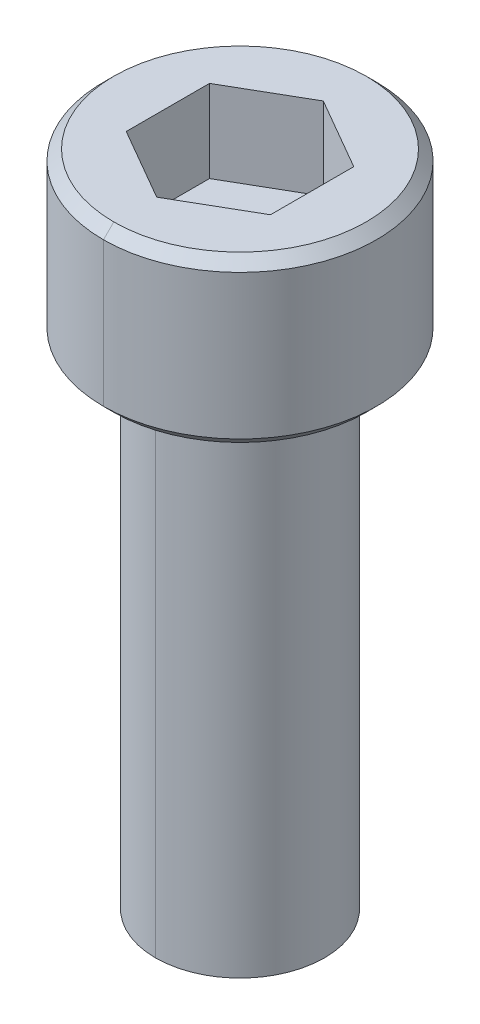
ISO-10303-21;
HEADER;
FILE_DESCRIPTION(('STEP AP214'),'2;1');
FILE_NAME('part.step','',(''),(''),'','','');
FILE_SCHEMA(('AUTOMOTIVE_DESIGN { 1 0 10303 214 1 1 1 1 }'));
ENDSEC;
DATA;
#1=APPLICATION_CONTEXT('core data for automotive mechanical design processes');
#2=APPLICATION_PROTOCOL_DEFINITION('international standard','automotive_design',2000,#1);
#3=PRODUCT_CONTEXT('',#1,'mechanical');
#4=PRODUCT('Part','Part','',(#3));
#5=PRODUCT_RELATED_PRODUCT_CATEGORY('part','',(#4));
#6=PRODUCT_DEFINITION_FORMATION('','',#4);
#7=PRODUCT_DEFINITION_CONTEXT('part definition',#1,'design');
#8=PRODUCT_DEFINITION('design','',#6,#7);
#9=PRODUCT_DEFINITION_SHAPE('','',#8);
#10=(LENGTH_UNIT() NAMED_UNIT(*) SI_UNIT(.MILLI.,.METRE.));
#11=(NAMED_UNIT(*) PLANE_ANGLE_UNIT() SI_UNIT($,.RADIAN.));
#12=(NAMED_UNIT(*) SI_UNIT($,.STERADIAN.) SOLID_ANGLE_UNIT());
#13=UNCERTAINTY_MEASURE_WITH_UNIT(LENGTH_MEASURE(1.E-05),#10,'distance_accuracy_value','');
#14=(GEOMETRIC_REPRESENTATION_CONTEXT(3) GLOBAL_UNCERTAINTY_ASSIGNED_CONTEXT((#13)) GLOBAL_UNIT_ASSIGNED_CONTEXT((#10,
#11,#12)) REPRESENTATION_CONTEXT('',''));
#15=CARTESIAN_POINT('',(0.,0.,0.));
#16=DIRECTION('',(0.,0.,1.));
#17=DIRECTION('',(1.,0.,0.));
#18=AXIS2_PLACEMENT_3D('',#15,#16,#17);
#19=CARTESIAN_POINT('',(0.,-12.16152,0.));
#20=DIRECTION('',(0.,1.,0.));
#21=DIRECTION('',(0.,0.,1.));
#22=AXIS2_PLACEMENT_3D('',#19,#20,#21);
#23=CONICAL_SURFACE('',#22,2.0828,0.960291895410485);
#24=DIRECTION('',(0.,0.573280843383967,-0.819358941251615));
#25=VECTOR('',#24,1.);
#26=CARTESIAN_POINT('',(0.,-12.16152,-2.0828));
#27=LINE('',#26,#25);
#28=CARTESIAN_POINT('',(0.,-12.7,-1.31318));
#29=VERTEX_POINT('',#28);
#30=CARTESIAN_POINT('',(0.,-12.16152,-2.0828));
#31=VERTEX_POINT('',#30);
#32=EDGE_CURVE('E160',#29,#31,#27,.T.);
#33=ORIENTED_EDGE('',*,*,#32,.F.);
#34=CARTESIAN_POINT('',(0.,-12.7,0.));
#35=DIRECTION('',(0.,-1.,0.));
#36=DIRECTION('',(0.,0.,1.));
#37=AXIS2_PLACEMENT_3D('',#34,#35,#36);
#38=CIRCLE('',#37,1.31318);
#39=CARTESIAN_POINT('',(0.,-12.7,1.31318));
#40=VERTEX_POINT('',#39);
#41=EDGE_CURVE('E147',#40,#29,#38,.T.);
#42=ORIENTED_EDGE('',*,*,#41,.F.);
#43=DIRECTION('',(0.,0.573280843383967,0.819358941251615));
#44=VECTOR('',#43,1.);
#45=CARTESIAN_POINT('',(0.,-12.16152,2.0828));
#46=LINE('',#45,#44);
#47=CARTESIAN_POINT('',(0.,-12.16152,2.0828));
#48=VERTEX_POINT('',#47);
#49=EDGE_CURVE('E169',#40,#48,#46,.T.);
#50=ORIENTED_EDGE('',*,*,#49,.T.);
#51=CARTESIAN_POINT('',(0.,-12.16152,0.));
#52=DIRECTION('',(0.,1.,0.));
#53=DIRECTION('',(0.,0.,1.));
#54=AXIS2_PLACEMENT_3D('',#51,#52,#53);
#55=CIRCLE('',#54,2.0828);
#56=EDGE_CURVE('E161',#31,#48,#55,.T.);
#57=ORIENTED_EDGE('',*,*,#56,.F.);
#58=EDGE_LOOP('',(#33,#42,#50,#57));
#59=FACE_BOUND('',#58,.T.);
#60=ADVANCED_FACE('F17',(#59),#23,.T.);
#61=CARTESIAN_POINT('',(0.,0.254000000000004,0.));
#62=DIRECTION('',(0.,1.,0.));
#63=DIRECTION('',(0.,0.,1.));
#64=AXIS2_PLACEMENT_3D('',#61,#62,#63);
#65=CONICAL_SURFACE('',#64,3.3655,0.78539816339745);
#66=DIRECTION('',(0.,0.707106781186546,-0.707106781186549));
#67=VECTOR('',#66,1.);
#68=CARTESIAN_POINT('',(0.,0.254000000000004,-3.3655));
#69=LINE('',#68,#67);
#70=CARTESIAN_POINT('',(0.,0.,-3.1115));
#71=VERTEX_POINT('',#70);
#72=CARTESIAN_POINT('',(0.,0.254000000000004,-3.3655));
#73=VERTEX_POINT('',#72);
#74=EDGE_CURVE('E21',#71,#73,#69,.T.);
#75=ORIENTED_EDGE('',*,*,#74,.F.);
#76=CARTESIAN_POINT('',(0.,0.,0.));
#77=DIRECTION('',(0.,-1.,0.));
#78=DIRECTION('',(0.,0.,1.));
#79=AXIS2_PLACEMENT_3D('',#76,#77,#78);
#80=CIRCLE('',#79,3.1115);
#81=CARTESIAN_POINT('',(0.,0.,3.1115));
#82=VERTEX_POINT('',#81);
#83=EDGE_CURVE('E183',#82,#71,#80,.T.);
#84=ORIENTED_EDGE('',*,*,#83,.F.);
#85=DIRECTION('',(0.,0.707106781186546,0.707106781186549));
#86=VECTOR('',#85,1.);
#87=CARTESIAN_POINT('',(0.,0.254000000000004,3.3655));
#88=LINE('',#87,#86);
#89=CARTESIAN_POINT('',(0.,0.254000000000004,3.3655));
#90=VERTEX_POINT('',#89);
#91=EDGE_CURVE('E200',#82,#90,#88,.T.);
#92=ORIENTED_EDGE('',*,*,#91,.T.);
#93=CARTESIAN_POINT('',(0.,0.254000000000004,0.));
#94=DIRECTION('',(0.,1.,0.));
#95=DIRECTION('',(0.,0.,1.));
#96=AXIS2_PLACEMENT_3D('',#93,#94,#95);
#97=CIRCLE('',#96,3.3655);
#98=EDGE_CURVE('E190',#73,#90,#97,.T.);
#99=ORIENTED_EDGE('',*,*,#98,.F.);
#100=EDGE_LOOP('',(#75,#84,#92,#99));
#101=FACE_BOUND('',#100,.T.);
#102=ADVANCED_FACE('F592',(#101),#65,.T.);
#103=CARTESIAN_POINT('',(0.,4.064,0.));
#104=DIRECTION('',(0.,-1.,0.));
#105=DIRECTION('',(0.,0.,-1.));
#106=AXIS2_PLACEMENT_3D('',#103,#104,#105);
#107=CONICAL_SURFACE('',#106,3.1115,0.785398163397446);
#108=DIRECTION('',(0.,-0.707106781186549,0.707106781186546));
#109=VECTOR('',#108,1.);
#110=CARTESIAN_POINT('',(0.,4.064,3.1115));
#111=LINE('',#110,#109);
#112=CARTESIAN_POINT('',(0.,4.064,3.1115));
#113=VERTEX_POINT('',#112);
#114=CARTESIAN_POINT('',(0.,3.81,3.3655));
#115=VERTEX_POINT('',#114);
#116=EDGE_CURVE('E213',#113,#115,#111,.T.);
#117=ORIENTED_EDGE('',*,*,#116,.F.);
#118=CARTESIAN_POINT('',(0.,4.064,0.));
#119=DIRECTION('',(0.,1.,0.));
#120=DIRECTION('',(0.,0.,1.));
#121=AXIS2_PLACEMENT_3D('',#118,#119,#120);
#122=CIRCLE('',#121,3.1115);
#123=CARTESIAN_POINT('',(0.,4.064,-3.1115));
#124=VERTEX_POINT('',#123);
#125=EDGE_CURVE('E193',#124,#113,#122,.T.);
#126=ORIENTED_EDGE('',*,*,#125,.F.);
#127=DIRECTION('',(0.,-0.707106781186549,-0.707106781186546));
#128=VECTOR('',#127,1.);
#129=CARTESIAN_POINT('',(0.,4.064,-3.1115));
#130=LINE('',#129,#128);
#131=CARTESIAN_POINT('',(0.,3.81,-3.3655));
#132=VERTEX_POINT('',#131);
#133=EDGE_CURVE('E199',#124,#132,#130,.T.);
#134=ORIENTED_EDGE('',*,*,#133,.T.);
#135=CARTESIAN_POINT('',(0.,3.81,0.));
#136=DIRECTION('',(0.,-1.,0.));
#137=DIRECTION('',(0.,0.,1.));
#138=AXIS2_PLACEMENT_3D('',#135,#136,#137);
#139=CIRCLE('',#138,3.3655);
#140=EDGE_CURVE('E156',#115,#132,#139,.T.);
#141=ORIENTED_EDGE('',*,*,#140,.F.);
#142=EDGE_LOOP('',(#117,#126,#134,#141));
#143=FACE_BOUND('',#142,.T.);
#144=ADVANCED_FACE('F583',(#143),#107,.T.);
#145=CARTESIAN_POINT('',(1.778,2.032,3.07958633585744));
#146=DIRECTION('',(0.,1.,0.));
#147=DIRECTION('',(0.,0.,-1.));
#148=AXIS2_PLACEMENT_3D('',#145,#146,#147);
#149=PLANE('',#148);
#150=DIRECTION('',(0.866025403784439,0.,0.5));
#151=VECTOR('',#150,1.);
#152=CARTESIAN_POINT('',(-1.778,2.032,1.02652877861915));
#153=LINE('',#152,#151);
#154=CARTESIAN_POINT('',(-1.778,2.032,1.02652877861915));
#155=VERTEX_POINT('',#154);
#156=CARTESIAN_POINT('',(0.,2.032,2.05305755723831));
#157=VERTEX_POINT('',#156);
#158=EDGE_CURVE('E182',#155,#157,#153,.T.);
#159=ORIENTED_EDGE('',*,*,#158,.T.);
#160=DIRECTION('',(0.866025403784439,0.,-0.5));
#161=VECTOR('',#160,1.);
#162=CARTESIAN_POINT('',(0.,2.032,2.05305755723831));
#163=LINE('',#162,#161);
#164=CARTESIAN_POINT('',(1.778,2.032,1.02652877861915));
#165=VERTEX_POINT('',#164);
#166=EDGE_CURVE('E11',#157,#165,#163,.T.);
#167=ORIENTED_EDGE('',*,*,#166,.T.);
#168=DIRECTION('',(0.,0.,-1.));
#169=VECTOR('',#168,1.);
#170=CARTESIAN_POINT('',(1.778,2.032,1.02652877861915));
#171=LINE('',#170,#169);
#172=CARTESIAN_POINT('',(1.778,2.032,-1.02652877861916));
#173=VERTEX_POINT('',#172);
#174=EDGE_CURVE('E177',#165,#173,#171,.T.);
#175=ORIENTED_EDGE('',*,*,#174,.T.);
#176=DIRECTION('',(-0.866025403784439,0.,-0.5));
#177=VECTOR('',#176,1.);
#178=CARTESIAN_POINT('',(1.778,2.032,-1.02652877861916));
#179=LINE('',#178,#177);
#180=CARTESIAN_POINT('',(0.,2.032,-2.05305755723829));
#181=VERTEX_POINT('',#180);
#182=EDGE_CURVE('E239',#173,#181,#179,.T.);
#183=ORIENTED_EDGE('',*,*,#182,.T.);
#184=DIRECTION('',(-0.866025403784439,0.,0.5));
#185=VECTOR('',#184,1.);
#186=CARTESIAN_POINT('',(0.,2.032,-2.05305755723829));
#187=LINE('',#186,#185);
#188=CARTESIAN_POINT('',(-1.778,2.032,-1.02652877861915));
#189=VERTEX_POINT('',#188);
#190=EDGE_CURVE('E240',#181,#189,#187,.T.);
#191=ORIENTED_EDGE('',*,*,#190,.T.);
#192=DIRECTION('',(0.,0.,1.));
#193=VECTOR('',#192,1.);
#194=CARTESIAN_POINT('',(-1.778,2.032,-1.02652877861915));
#195=LINE('',#194,#193);
#196=EDGE_CURVE('E259',#189,#155,#195,.T.);
#197=ORIENTED_EDGE('',*,*,#196,.T.);
#198=EDGE_LOOP('',(#159,#167,#175,#183,#191,#197));
#199=FACE_BOUND('',#198,.T.);
#200=ADVANCED_FACE('F280',(#199),#149,.T.);
#201=CARTESIAN_POINT('',(0.,2.032,2.05305755723831));
#202=DIRECTION('',(0.5,0.,0.866025403784439));
#203=DIRECTION('',(0.,-1.,0.));
#204=AXIS2_PLACEMENT_3D('',#201,#202,#203);
#205=PLANE('',#204);
#206=DIRECTION('',(0.866025403784439,0.,-0.5));
#207=VECTOR('',#206,1.);
#208=CARTESIAN_POINT('',(0.,4.064,2.05305755723831));
#209=LINE('',#208,#207);
#210=CARTESIAN_POINT('',(0.,4.064,2.05305755723831));
#211=VERTEX_POINT('',#210);
#212=CARTESIAN_POINT('',(1.778,4.064,1.02652877861915));
#213=VERTEX_POINT('',#212);
#214=EDGE_CURVE('E265',#211,#213,#209,.T.);
#215=ORIENTED_EDGE('',*,*,#214,.T.);
#216=DIRECTION('',(0.,1.,0.));
#217=VECTOR('',#216,1.);
#218=CARTESIAN_POINT('',(1.778,2.032,1.02652877861915));
#219=LINE('',#218,#217);
#220=EDGE_CURVE('E28',#165,#213,#219,.T.);
#221=ORIENTED_EDGE('',*,*,#220,.F.);
#222=ORIENTED_EDGE('',*,*,#166,.F.);
#223=DIRECTION('',(0.,1.,0.));
#224=VECTOR('',#223,1.);
#225=CARTESIAN_POINT('',(0.,2.032,2.05305755723831));
#226=LINE('',#225,#224);
#227=EDGE_CURVE('E179',#157,#211,#226,.T.);
#228=ORIENTED_EDGE('',*,*,#227,.T.);
#229=EDGE_LOOP('',(#215,#221,#222,#228));
#230=FACE_BOUND('',#229,.T.);
#231=ADVANCED_FACE('F565',(#230),#205,.F.);
#232=CARTESIAN_POINT('',(1.778,2.032,1.02652877861915));
#233=DIRECTION('',(1.,0.,0.));
#234=DIRECTION('',(0.,0.,-1.));
#235=AXIS2_PLACEMENT_3D('',#232,#233,#234);
#236=PLANE('',#235);
#237=DIRECTION('',(0.,0.,-1.));
#238=VECTOR('',#237,1.);
#239=CARTESIAN_POINT('',(1.778,4.064,1.02652877861915));
#240=LINE('',#239,#238);
#241=CARTESIAN_POINT('',(1.778,4.064,-1.02652877861916));
#242=VERTEX_POINT('',#241);
#243=EDGE_CURVE('E270',#213,#242,#240,.T.);
#244=ORIENTED_EDGE('',*,*,#243,.T.);
#245=DIRECTION('',(0.,1.,0.));
#246=VECTOR('',#245,1.);
#247=CARTESIAN_POINT('',(1.778,2.032,-1.02652877861916));
#248=LINE('',#247,#246);
#249=EDGE_CURVE('E250',#173,#242,#248,.T.);
#250=ORIENTED_EDGE('',*,*,#249,.F.);
#251=ORIENTED_EDGE('',*,*,#174,.F.);
#252=ORIENTED_EDGE('',*,*,#220,.T.);
#253=EDGE_LOOP('',(#244,#250,#251,#252));
#254=FACE_BOUND('',#253,.T.);
#255=ADVANCED_FACE('F281',(#254),#236,.F.);
#256=CARTESIAN_POINT('',(1.778,2.032,-1.02652877861916));
#257=DIRECTION('',(0.5,0.,-0.866025403784439));
#258=DIRECTION('',(0.,-1.,0.));
#259=AXIS2_PLACEMENT_3D('',#256,#257,#258);
#260=PLANE('',#259);
#261=DIRECTION('',(-0.866025403784439,0.,-0.5));
#262=VECTOR('',#261,1.);
#263=CARTESIAN_POINT('',(1.778,4.064,-1.02652877861916));
#264=LINE('',#263,#262);
#265=CARTESIAN_POINT('',(0.,4.064,-2.05305755723829));
#266=VERTEX_POINT('',#265);
#267=EDGE_CURVE('E285',#242,#266,#264,.T.);
#268=ORIENTED_EDGE('',*,*,#267,.T.);
#269=DIRECTION('',(0.,1.,0.));
#270=VECTOR('',#269,1.);
#271=CARTESIAN_POINT('',(0.,2.032,-2.05305755723829));
#272=LINE('',#271,#270);
#273=EDGE_CURVE('E237',#181,#266,#272,.T.);
#274=ORIENTED_EDGE('',*,*,#273,.F.);
#275=ORIENTED_EDGE('',*,*,#182,.F.);
#276=ORIENTED_EDGE('',*,*,#249,.T.);
#277=EDGE_LOOP('',(#268,#274,#275,#276));
#278=FACE_BOUND('',#277,.T.);
#279=ADVANCED_FACE('F284',(#278),#260,.F.);
#280=CARTESIAN_POINT('',(0.,2.032,-2.05305755723829));
#281=DIRECTION('',(-0.5,0.,-0.866025403784439));
#282=DIRECTION('',(-0.866025403784439,0.,0.5));
#283=AXIS2_PLACEMENT_3D('',#280,#281,#282);
#284=PLANE('',#283);
#285=DIRECTION('',(-0.866025403784439,0.,0.5));
#286=VECTOR('',#285,1.);
#287=CARTESIAN_POINT('',(0.,4.064,-2.05305755723829));
#288=LINE('',#287,#286);
#289=CARTESIAN_POINT('',(-1.778,4.064,-1.02652877861915));
#290=VERTEX_POINT('',#289);
#291=EDGE_CURVE('E188',#266,#290,#288,.T.);
#292=ORIENTED_EDGE('',*,*,#291,.T.);
#293=DIRECTION('',(0.,1.,0.));
#294=VECTOR('',#293,1.);
#295=CARTESIAN_POINT('',(-1.778,2.032,-1.02652877861915));
#296=LINE('',#295,#294);
#297=EDGE_CURVE('E253',#189,#290,#296,.T.);
#298=ORIENTED_EDGE('',*,*,#297,.F.);
#299=ORIENTED_EDGE('',*,*,#190,.F.);
#300=ORIENTED_EDGE('',*,*,#273,.T.);
#301=EDGE_LOOP('',(#292,#298,#299,#300));
#302=FACE_BOUND('',#301,.T.);
#303=ADVANCED_FACE('F287',(#302),#284,.F.);
#304=CARTESIAN_POINT('',(-1.778,2.032,-1.02652877861915));
#305=DIRECTION('',(-1.,0.,0.));
#306=DIRECTION('',(0.,1.,0.));
#307=AXIS2_PLACEMENT_3D('',#304,#305,#306);
#308=PLANE('',#307);
#309=DIRECTION('',(0.,0.,1.));
#310=VECTOR('',#309,1.);
#311=CARTESIAN_POINT('',(-1.778,4.064,-1.02652877861915));
#312=LINE('',#311,#310);
#313=CARTESIAN_POINT('',(-1.778,4.064,1.02652877861915));
#314=VERTEX_POINT('',#313);
#315=EDGE_CURVE('E184',#290,#314,#312,.T.);
#316=ORIENTED_EDGE('',*,*,#315,.T.);
#317=DIRECTION('',(0.,1.,0.));
#318=VECTOR('',#317,1.);
#319=CARTESIAN_POINT('',(-1.778,2.032,1.02652877861915));
#320=LINE('',#319,#318);
#321=EDGE_CURVE('E293',#155,#314,#320,.T.);
#322=ORIENTED_EDGE('',*,*,#321,.F.);
#323=ORIENTED_EDGE('',*,*,#196,.F.);
#324=ORIENTED_EDGE('',*,*,#297,.T.);
#325=EDGE_LOOP('',(#316,#322,#323,#324));
#326=FACE_BOUND('',#325,.T.);
#327=ADVANCED_FACE('F292',(#326),#308,.F.);
#328=CARTESIAN_POINT('',(-1.778,2.032,1.02652877861915));
#329=DIRECTION('',(-0.5,0.,0.866025403784439));
#330=DIRECTION('',(0.,1.,0.));
#331=AXIS2_PLACEMENT_3D('',#328,#329,#330);
#332=PLANE('',#331);
#333=DIRECTION('',(0.866025403784439,0.,0.5));
#334=VECTOR('',#333,1.);
#335=CARTESIAN_POINT('',(-1.778,4.064,1.02652877861915));
#336=LINE('',#335,#334);
#337=EDGE_CURVE('E189',#314,#211,#336,.T.);
#338=ORIENTED_EDGE('',*,*,#337,.T.);
#339=ORIENTED_EDGE('',*,*,#227,.F.);
#340=ORIENTED_EDGE('',*,*,#158,.F.);
#341=ORIENTED_EDGE('',*,*,#321,.T.);
#342=EDGE_LOOP('',(#338,#339,#340,#341));
#343=FACE_BOUND('',#342,.T.);
#344=ADVANCED_FACE('F520',(#343),#332,.F.);
#345=CARTESIAN_POINT('',(0.,0.,0.));
#346=DIRECTION('',(0.,1.,0.));
#347=DIRECTION('',(0.,0.,-1.));
#348=AXIS2_PLACEMENT_3D('',#345,#346,#347);
#349=PLANE('',#348);
#350=CARTESIAN_POINT('',(0.,0.,0.));
#351=DIRECTION('',(0.,1.,0.));
#352=DIRECTION('',(0.,0.,1.));
#353=AXIS2_PLACEMENT_3D('',#350,#351,#352);
#354=CIRCLE('',#353,2.0828);
#355=CARTESIAN_POINT('',(0.,0.,2.0828));
#356=VERTEX_POINT('',#355);
#357=CARTESIAN_POINT('',(0.,0.,-2.0828));
#358=VERTEX_POINT('',#357);
#359=EDGE_CURVE('E214',#356,#358,#354,.T.);
#360=ORIENTED_EDGE('',*,*,#359,.T.);
#361=CARTESIAN_POINT('',(0.,0.,0.));
#362=DIRECTION('',(0.,1.,0.));
#363=DIRECTION('',(0.,0.,1.));
#364=AXIS2_PLACEMENT_3D('',#361,#362,#363);
#365=CIRCLE('',#364,2.0828);
#366=EDGE_CURVE('E157',#358,#356,#365,.T.);
#367=ORIENTED_EDGE('',*,*,#366,.T.);
#368=EDGE_LOOP('',(#360,#367));
#369=FACE_BOUND('',#368,.T.);
#370=ORIENTED_EDGE('',*,*,#83,.T.);
#371=CARTESIAN_POINT('',(0.,0.,0.));
#372=DIRECTION('',(0.,-1.,0.));
#373=DIRECTION('',(0.,0.,1.));
#374=AXIS2_PLACEMENT_3D('',#371,#372,#373);
#375=CIRCLE('',#374,3.1115);
#376=EDGE_CURVE('E230',#71,#82,#375,.T.);
#377=ORIENTED_EDGE('',*,*,#376,.T.);
#378=EDGE_LOOP('',(#370,#377));
#379=FACE_BOUND('',#378,.T.);
#380=ADVANCED_FACE('F19',(#369,#379),#349,.F.);
#381=CARTESIAN_POINT('',(0.,4.064,0.));
#382=DIRECTION('',(0.,1.,0.));
#383=DIRECTION('',(0.,0.,-1.));
#384=AXIS2_PLACEMENT_3D('',#381,#382,#383);
#385=PLANE('',#384);
#386=ORIENTED_EDGE('',*,*,#337,.F.);
#387=ORIENTED_EDGE('',*,*,#315,.F.);
#388=ORIENTED_EDGE('',*,*,#291,.F.);
#389=ORIENTED_EDGE('',*,*,#267,.F.);
#390=ORIENTED_EDGE('',*,*,#243,.F.);
#391=ORIENTED_EDGE('',*,*,#214,.F.);
#392=EDGE_LOOP('',(#386,#387,#388,#389,#390,#391));
#393=FACE_BOUND('',#392,.T.);
#394=ORIENTED_EDGE('',*,*,#125,.T.);
#395=CARTESIAN_POINT('',(0.,4.064,0.));
#396=DIRECTION('',(0.,1.,0.));
#397=DIRECTION('',(0.,0.,1.));
#398=AXIS2_PLACEMENT_3D('',#395,#396,#397);
#399=CIRCLE('',#398,3.1115);
#400=EDGE_CURVE('E204',#113,#124,#399,.T.);
#401=ORIENTED_EDGE('',*,*,#400,.T.);
#402=EDGE_LOOP('',(#394,#401));
#403=FACE_BOUND('',#402,.T.);
#404=ADVANCED_FACE('F503',(#393,#403),#385,.T.);
#405=CARTESIAN_POINT('',(0.,4.064,0.));
#406=DIRECTION('',(0.,-1.,0.));
#407=DIRECTION('',(0.,0.,-1.));
#408=AXIS2_PLACEMENT_3D('',#405,#406,#407);
#409=CYLINDRICAL_SURFACE('',#408,3.3655);
#410=DIRECTION('',(0.,-1.,0.));
#411=VECTOR('',#410,1.);
#412=CARTESIAN_POINT('',(0.,4.064,3.3655));
#413=LINE('',#412,#411);
#414=EDGE_CURVE('E194',#115,#90,#413,.T.);
#415=ORIENTED_EDGE('',*,*,#414,.F.);
#416=ORIENTED_EDGE('',*,*,#140,.T.);
#417=DIRECTION('',(0.,-1.,0.));
#418=VECTOR('',#417,1.);
#419=CARTESIAN_POINT('',(0.,4.064,-3.3655));
#420=LINE('',#419,#418);
#421=EDGE_CURVE('E198',#132,#73,#420,.T.);
#422=ORIENTED_EDGE('',*,*,#421,.T.);
#423=ORIENTED_EDGE('',*,*,#98,.T.);
#424=EDGE_LOOP('',(#415,#416,#422,#423));
#425=FACE_BOUND('',#424,.T.);
#426=ADVANCED_FACE('F493',(#425),#409,.T.);
#427=CARTESIAN_POINT('',(0.,-12.7,0.));
#428=DIRECTION('',(0.,1.,0.));
#429=DIRECTION('',(0.,0.,-1.));
#430=AXIS2_PLACEMENT_3D('',#427,#428,#429);
#431=PLANE('',#430);
#432=ORIENTED_EDGE('',*,*,#41,.T.);
#433=CARTESIAN_POINT('',(0.,-12.7,0.));
#434=DIRECTION('',(0.,-1.,0.));
#435=DIRECTION('',(0.,0.,1.));
#436=AXIS2_PLACEMENT_3D('',#433,#434,#435);
#437=CIRCLE('',#436,1.31318);
#438=EDGE_CURVE('E151',#29,#40,#437,.T.);
#439=ORIENTED_EDGE('',*,*,#438,.T.);
#440=EDGE_LOOP('',(#432,#439));
#441=FACE_BOUND('',#440,.T.);
#442=ADVANCED_FACE('F149',(#441),#431,.F.);
#443=CARTESIAN_POINT('',(0.,-12.7,0.));
#444=DIRECTION('',(0.,1.,0.));
#445=DIRECTION('',(0.,0.,1.));
#446=AXIS2_PLACEMENT_3D('',#443,#444,#445);
#447=CYLINDRICAL_SURFACE('',#446,2.0828);
#448=DIRECTION('',(0.,1.,0.));
#449=VECTOR('',#448,1.);
#450=CARTESIAN_POINT('',(0.,-12.7,-2.0828));
#451=LINE('',#450,#449);
#452=EDGE_CURVE('E219',#31,#358,#451,.T.);
#453=ORIENTED_EDGE('',*,*,#452,.F.);
#454=ORIENTED_EDGE('',*,*,#56,.T.);
#455=DIRECTION('',(0.,1.,0.));
#456=VECTOR('',#455,1.);
#457=CARTESIAN_POINT('',(0.,-12.7,2.0828));
#458=LINE('',#457,#456);
#459=EDGE_CURVE('E218',#48,#356,#458,.T.);
#460=ORIENTED_EDGE('',*,*,#459,.T.);
#461=ORIENTED_EDGE('',*,*,#366,.F.);
#462=EDGE_LOOP('',(#453,#454,#460,#461));
#463=FACE_BOUND('',#462,.T.);
#464=ADVANCED_FACE('F471',(#463),#447,.T.);
#465=CARTESIAN_POINT('',(0.,-12.7,0.));
#466=DIRECTION('',(0.,1.,0.));
#467=DIRECTION('',(0.,0.,1.));
#468=AXIS2_PLACEMENT_3D('',#465,#466,#467);
#469=CYLINDRICAL_SURFACE('',#468,2.0828);
#470=CARTESIAN_POINT('',(0.,-12.16152,0.));
#471=DIRECTION('',(0.,1.,0.));
#472=DIRECTION('',(0.,0.,1.));
#473=AXIS2_PLACEMENT_3D('',#470,#471,#472);
#474=CIRCLE('',#473,2.0828);
#475=EDGE_CURVE('E166',#48,#31,#474,.T.);
#476=ORIENTED_EDGE('',*,*,#475,.T.);
#477=ORIENTED_EDGE('',*,*,#452,.T.);
#478=ORIENTED_EDGE('',*,*,#359,.F.);
#479=ORIENTED_EDGE('',*,*,#459,.F.);
#480=EDGE_LOOP('',(#476,#477,#478,#479));
#481=FACE_BOUND('',#480,.T.);
#482=ADVANCED_FACE('F459',(#481),#469,.T.);
#483=CARTESIAN_POINT('',(0.,4.064,0.));
#484=DIRECTION('',(0.,-1.,0.));
#485=DIRECTION('',(0.,0.,-1.));
#486=AXIS2_PLACEMENT_3D('',#483,#484,#485);
#487=CYLINDRICAL_SURFACE('',#486,3.3655);
#488=CARTESIAN_POINT('',(0.,3.81,0.));
#489=DIRECTION('',(0.,-1.,0.));
#490=DIRECTION('',(0.,0.,1.));
#491=AXIS2_PLACEMENT_3D('',#488,#489,#490);
#492=CIRCLE('',#491,3.3655);
#493=EDGE_CURVE('E234',#132,#115,#492,.T.);
#494=ORIENTED_EDGE('',*,*,#493,.T.);
#495=ORIENTED_EDGE('',*,*,#414,.T.);
#496=CARTESIAN_POINT('',(0.,0.254000000000004,0.));
#497=DIRECTION('',(0.,1.,0.));
#498=DIRECTION('',(0.,0.,1.));
#499=AXIS2_PLACEMENT_3D('',#496,#497,#498);
#500=CIRCLE('',#499,3.3655);
#501=EDGE_CURVE('E205',#90,#73,#500,.T.);
#502=ORIENTED_EDGE('',*,*,#501,.T.);
#503=ORIENTED_EDGE('',*,*,#421,.F.);
#504=EDGE_LOOP('',(#494,#495,#502,#503));
#505=FACE_BOUND('',#504,.T.);
#506=ADVANCED_FACE('F447',(#505),#487,.T.);
#507=CARTESIAN_POINT('',(0.,4.064,0.));
#508=DIRECTION('',(0.,-1.,0.));
#509=DIRECTION('',(0.,0.,-1.));
#510=AXIS2_PLACEMENT_3D('',#507,#508,#509);
#511=CONICAL_SURFACE('',#510,3.1115,0.785398163397446);
#512=ORIENTED_EDGE('',*,*,#400,.F.);
#513=ORIENTED_EDGE('',*,*,#116,.T.);
#514=ORIENTED_EDGE('',*,*,#493,.F.);
#515=ORIENTED_EDGE('',*,*,#133,.F.);
#516=EDGE_LOOP('',(#512,#513,#514,#515));
#517=FACE_BOUND('',#516,.T.);
#518=ADVANCED_FACE('F434',(#517),#511,.T.);
#519=CARTESIAN_POINT('',(0.,0.254000000000004,0.));
#520=DIRECTION('',(0.,1.,0.));
#521=DIRECTION('',(0.,0.,1.));
#522=AXIS2_PLACEMENT_3D('',#519,#520,#521);
#523=CONICAL_SURFACE('',#522,3.3655,0.78539816339745);
#524=ORIENTED_EDGE('',*,*,#376,.F.);
#525=ORIENTED_EDGE('',*,*,#74,.T.);
#526=ORIENTED_EDGE('',*,*,#501,.F.);
#527=ORIENTED_EDGE('',*,*,#91,.F.);
#528=EDGE_LOOP('',(#524,#525,#526,#527));
#529=FACE_BOUND('',#528,.T.);
#530=ADVANCED_FACE('F421',(#529),#523,.T.);
#531=CARTESIAN_POINT('',(0.,-12.16152,0.));
#532=DIRECTION('',(0.,1.,0.));
#533=DIRECTION('',(0.,0.,1.));
#534=AXIS2_PLACEMENT_3D('',#531,#532,#533);
#535=CONICAL_SURFACE('',#534,2.0828,0.960291895410485);
#536=ORIENTED_EDGE('',*,*,#438,.F.);
#537=ORIENTED_EDGE('',*,*,#32,.T.);
#538=ORIENTED_EDGE('',*,*,#475,.F.);
#539=ORIENTED_EDGE('',*,*,#49,.F.);
#540=EDGE_LOOP('',(#536,#537,#538,#539));
#541=FACE_BOUND('',#540,.T.);
#542=ADVANCED_FACE('F168',(#541),#535,.T.);
#543=CLOSED_SHELL('',(#60,#102,#144,#200,#231,#255,#279,#303,#327,#344,#380,#404,#426,#442,#464,
#482,#506,#518,#530,#542));
#544=MANIFOLD_SOLID_BREP('B1',#543);
#545=ADVANCED_BREP_SHAPE_REPRESENTATION('',(#18,#544),#14);
#546=SHAPE_DEFINITION_REPRESENTATION(#9,#545);
ENDSEC;
END-ISO-10303-21;
